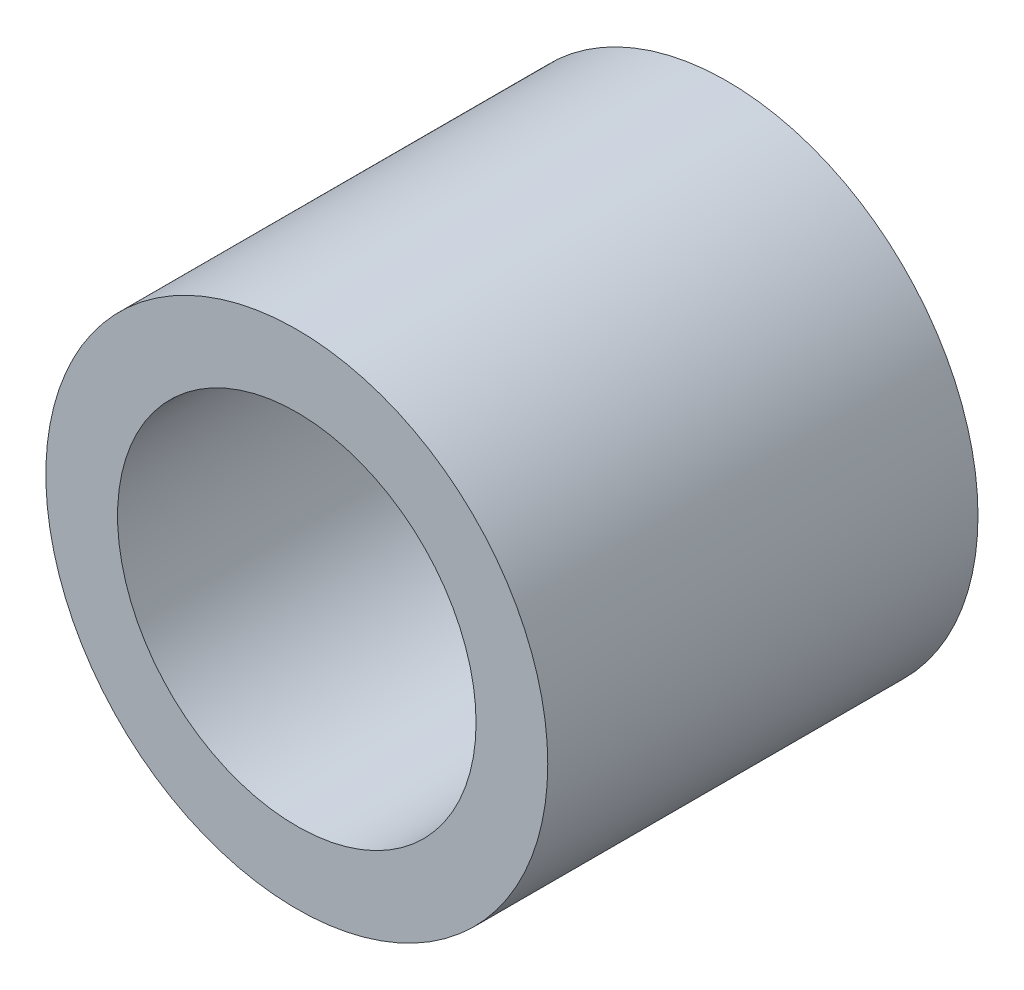
ISO-10303-21;
HEADER;
FILE_DESCRIPTION(('STEP AP214'),'2;1');
FILE_NAME('part.step','',(''),(''),'','','');
FILE_SCHEMA(('AUTOMOTIVE_DESIGN { 1 0 10303 214 1 1 1 1 }'));
ENDSEC;
DATA;
#1=APPLICATION_CONTEXT('core data for automotive mechanical design processes');
#2=APPLICATION_PROTOCOL_DEFINITION('international standard','automotive_design',2000,#1);
#3=PRODUCT_CONTEXT('',#1,'mechanical');
#4=PRODUCT('Part','Part','',(#3));
#5=PRODUCT_RELATED_PRODUCT_CATEGORY('part','',(#4));
#6=PRODUCT_DEFINITION_FORMATION('','',#4);
#7=PRODUCT_DEFINITION_CONTEXT('part definition',#1,'design');
#8=PRODUCT_DEFINITION('design','',#6,#7);
#9=PRODUCT_DEFINITION_SHAPE('','',#8);
#10=(LENGTH_UNIT() NAMED_UNIT(*) SI_UNIT(.MILLI.,.METRE.));
#11=(NAMED_UNIT(*) PLANE_ANGLE_UNIT() SI_UNIT($,.RADIAN.));
#12=(NAMED_UNIT(*) SI_UNIT($,.STERADIAN.) SOLID_ANGLE_UNIT());
#13=UNCERTAINTY_MEASURE_WITH_UNIT(LENGTH_MEASURE(1.E-05),#10,'distance_accuracy_value','');
#14=(GEOMETRIC_REPRESENTATION_CONTEXT(3) GLOBAL_UNCERTAINTY_ASSIGNED_CONTEXT((#13)) GLOBAL_UNIT_ASSIGNED_CONTEXT((#10,
#11,#12)) REPRESENTATION_CONTEXT('',''));
#15=CARTESIAN_POINT('',(0.,0.,0.));
#16=DIRECTION('',(0.,0.,1.));
#17=DIRECTION('',(1.,0.,0.));
#18=AXIS2_PLACEMENT_3D('',#15,#16,#17);
#19=CARTESIAN_POINT('',(0.,0.,6.));
#20=DIRECTION('',(0.,0.,1.));
#21=DIRECTION('',(1.,0.,0.));
#22=AXIS2_PLACEMENT_3D('',#19,#20,#21);
#23=PLANE('',#22);
#24=CARTESIAN_POINT('',(0.,0.,6.));
#25=DIRECTION('',(0.,0.,1.));
#26=DIRECTION('',(1.,0.,0.));
#27=AXIS2_PLACEMENT_3D('',#24,#25,#26);
#28=CIRCLE('',#27,3.5);
#29=CARTESIAN_POINT('',(3.5,0.,6.));
#30=VERTEX_POINT('',#29);
#31=EDGE_CURVE('E10',#30,#30,#28,.T.);
#32=ORIENTED_EDGE('',*,*,#31,.T.);
#33=EDGE_LOOP('',(#32));
#34=FACE_BOUND('',#33,.T.);
#35=CARTESIAN_POINT('',(0.,0.,6.));
#36=DIRECTION('',(0.,0.,1.));
#37=DIRECTION('',(1.,0.,0.));
#38=AXIS2_PLACEMENT_3D('',#35,#36,#37);
#39=CIRCLE('',#38,2.5);
#40=CARTESIAN_POINT('',(2.5,0.,6.));
#41=VERTEX_POINT('',#40);
#42=EDGE_CURVE('E50',#41,#41,#39,.T.);
#43=ORIENTED_EDGE('',*,*,#42,.F.);
#44=EDGE_LOOP('',(#43));
#45=FACE_BOUND('',#44,.T.);
#46=ADVANCED_FACE('F37',(#34,#45),#23,.T.);
#47=CARTESIAN_POINT('',(0.,0.,0.));
#48=DIRECTION('',(0.,0.,1.));
#49=DIRECTION('',(1.,0.,0.));
#50=AXIS2_PLACEMENT_3D('',#47,#48,#49);
#51=PLANE('',#50);
#52=CARTESIAN_POINT('',(0.,0.,0.));
#53=DIRECTION('',(0.,0.,1.));
#54=DIRECTION('',(1.,0.,0.));
#55=AXIS2_PLACEMENT_3D('',#52,#53,#54);
#56=CIRCLE('',#55,3.5);
#57=CARTESIAN_POINT('',(3.5,0.,0.));
#58=VERTEX_POINT('',#57);
#59=EDGE_CURVE('E41',#58,#58,#56,.T.);
#60=ORIENTED_EDGE('',*,*,#59,.F.);
#61=EDGE_LOOP('',(#60));
#62=FACE_BOUND('',#61,.T.);
#63=CARTESIAN_POINT('',(0.,0.,0.));
#64=DIRECTION('',(0.,0.,1.));
#65=DIRECTION('',(1.,0.,0.));
#66=AXIS2_PLACEMENT_3D('',#63,#64,#65);
#67=CIRCLE('',#66,2.5);
#68=CARTESIAN_POINT('',(2.5,0.,0.));
#69=VERTEX_POINT('',#68);
#70=EDGE_CURVE('E52',#69,#69,#67,.T.);
#71=ORIENTED_EDGE('',*,*,#70,.T.);
#72=EDGE_LOOP('',(#71));
#73=FACE_BOUND('',#72,.T.);
#74=ADVANCED_FACE('F64',(#62,#73),#51,.F.);
#75=CARTESIAN_POINT('',(0.,0.,6.));
#76=DIRECTION('',(0.,0.,-1.));
#77=DIRECTION('',(-1.,0.,0.));
#78=AXIS2_PLACEMENT_3D('',#75,#76,#77);
#79=CYLINDRICAL_SURFACE('',#78,3.5);
#80=ORIENTED_EDGE('',*,*,#31,.F.);
#81=EDGE_LOOP('',(#80));
#82=FACE_BOUND('',#81,.T.);
#83=ORIENTED_EDGE('',*,*,#59,.T.);
#84=EDGE_LOOP('',(#83));
#85=FACE_BOUND('',#84,.T.);
#86=ADVANCED_FACE('F39',(#82,#85),#79,.T.);
#87=CARTESIAN_POINT('',(0.,0.,6.));
#88=DIRECTION('',(0.,0.,-1.));
#89=DIRECTION('',(-1.,0.,0.));
#90=AXIS2_PLACEMENT_3D('',#87,#88,#89);
#91=CYLINDRICAL_SURFACE('',#90,2.5);
#92=ORIENTED_EDGE('',*,*,#42,.T.);
#93=EDGE_LOOP('',(#92));
#94=FACE_BOUND('',#93,.T.);
#95=ORIENTED_EDGE('',*,*,#70,.F.);
#96=EDGE_LOOP('',(#95));
#97=FACE_BOUND('',#96,.T.);
#98=ADVANCED_FACE('F60',(#94,#97),#91,.F.);
#99=CLOSED_SHELL('',(#46,#74,#86,#98));
#100=MANIFOLD_SOLID_BREP('B2',#99);
#101=ADVANCED_BREP_SHAPE_REPRESENTATION('',(#18,#100),#14);
#102=SHAPE_DEFINITION_REPRESENTATION(#9,#101);
ENDSEC;
END-ISO-10303-21;
